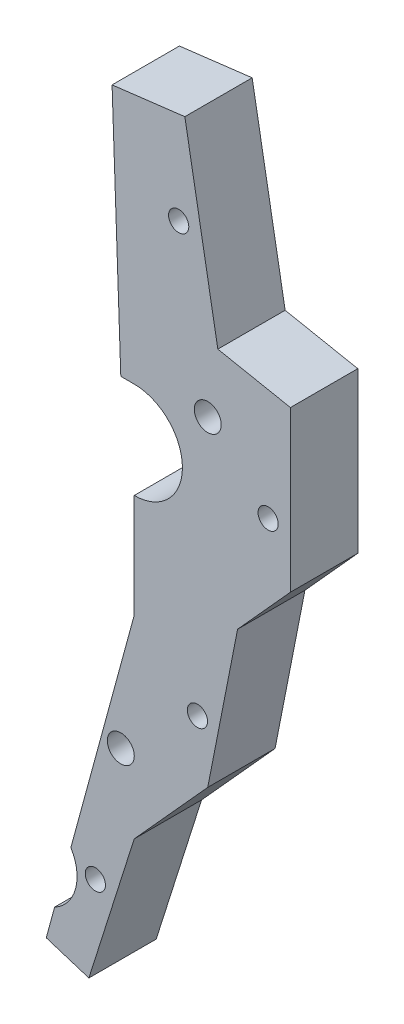
ISO-10303-21;
HEADER;
FILE_DESCRIPTION(('STEP AP214'),'2;1');
FILE_NAME('part.step','',(''),(''),'','','');
FILE_SCHEMA(('AUTOMOTIVE_DESIGN { 1 0 10303 214 1 1 1 1 }'));
ENDSEC;
DATA;
#1=APPLICATION_CONTEXT('core data for automotive mechanical design processes');
#2=APPLICATION_PROTOCOL_DEFINITION('international standard','automotive_design',2000,#1);
#3=PRODUCT_CONTEXT('',#1,'mechanical');
#4=PRODUCT('Part','Part','',(#3));
#5=PRODUCT_RELATED_PRODUCT_CATEGORY('part','',(#4));
#6=PRODUCT_DEFINITION_FORMATION('','',#4);
#7=PRODUCT_DEFINITION_CONTEXT('part definition',#1,'design');
#8=PRODUCT_DEFINITION('design','',#6,#7);
#9=PRODUCT_DEFINITION_SHAPE('','',#8);
#10=(LENGTH_UNIT() NAMED_UNIT(*) SI_UNIT(.MILLI.,.METRE.));
#11=(NAMED_UNIT(*) PLANE_ANGLE_UNIT() SI_UNIT($,.RADIAN.));
#12=(NAMED_UNIT(*) SI_UNIT($,.STERADIAN.) SOLID_ANGLE_UNIT());
#13=UNCERTAINTY_MEASURE_WITH_UNIT(LENGTH_MEASURE(1.E-05),#10,'distance_accuracy_value','');
#14=(GEOMETRIC_REPRESENTATION_CONTEXT(3) GLOBAL_UNCERTAINTY_ASSIGNED_CONTEXT((#13)) GLOBAL_UNIT_ASSIGNED_CONTEXT((#10,
#11,#12)) REPRESENTATION_CONTEXT('',''));
#15=CARTESIAN_POINT('',(0.,0.,0.));
#16=DIRECTION('',(0.,0.,1.));
#17=DIRECTION('',(1.,0.,0.));
#18=AXIS2_PLACEMENT_3D('',#15,#16,#17);
#19=CARTESIAN_POINT('',(-64.6270624834194,-32.1104240071964,5.));
#20=DIRECTION('',(0.964903774312297,-0.262603705834253,0.));
#21=DIRECTION('',(0.262603705834253,0.964903774312298,0.));
#22=AXIS2_PLACEMENT_3D('',#19,#20,#21);
#23=PLANE('',#22);
#24=DIRECTION('',(0.,0.,-1.));
#25=VECTOR('',#24,1.);
#26=CARTESIAN_POINT('',(-64.0052667859932,-29.8257151399258,5.));
#27=LINE('',#26,#25);
#28=CARTESIAN_POINT('',(-64.0052667859932,-29.8257151399258,0.));
#29=VERTEX_POINT('',#28);
#30=CARTESIAN_POINT('',(-64.0052667859932,-29.8257151399258,5.));
#31=VERTEX_POINT('',#30);
#32=EDGE_CURVE('E11',#29,#31,#27,.F.);
#33=ORIENTED_EDGE('',*,*,#32,.F.);
#34=DIRECTION('',(-0.262603705834253,-0.964903774312297,0.));
#35=VECTOR('',#34,1.);
#36=CARTESIAN_POINT('',(-64.6270624834194,-32.1104240071964,0.));
#37=LINE('',#36,#35);
#38=CARTESIAN_POINT('',(-64.6270624834194,-32.1104240071964,0.));
#39=VERTEX_POINT('',#38);
#40=EDGE_CURVE('E193',#29,#39,#37,.T.);
#41=ORIENTED_EDGE('',*,*,#40,.T.);
#42=DIRECTION('',(0.,0.,-1.));
#43=VECTOR('',#42,1.);
#44=CARTESIAN_POINT('',(-64.6270624834194,-32.1104240071964,5.));
#45=LINE('',#44,#43);
#46=CARTESIAN_POINT('',(-64.6270624834194,-32.1104240071964,5.));
#47=VERTEX_POINT('',#46);
#48=EDGE_CURVE('E227',#47,#39,#45,.T.);
#49=ORIENTED_EDGE('',*,*,#48,.F.);
#50=DIRECTION('',(-0.262603705834253,-0.964903774312297,0.));
#51=VECTOR('',#50,1.);
#52=CARTESIAN_POINT('',(-64.6270624834194,-32.1104240071964,5.));
#53=LINE('',#52,#51);
#54=EDGE_CURVE('E522',#31,#47,#53,.T.);
#55=ORIENTED_EDGE('',*,*,#54,.F.);
#56=EDGE_LOOP('',(#33,#41,#49,#55));
#57=FACE_BOUND('',#56,.T.);
#58=ADVANCED_FACE('F35',(#57),#23,.F.);
#59=DIRECTION('',(0.,0.,-1.));
#60=VECTOR('',#59,1.);
#61=CARTESIAN_POINT('',(-62.7993520569552,-25.3947355014205,5.));
#62=LINE('',#61,#60);
#63=CARTESIAN_POINT('',(-62.7993520569552,-25.3947355014206,5.));
#64=VERTEX_POINT('',#63);
#65=CARTESIAN_POINT('',(-62.7993520569552,-25.3947355014205,0.));
#66=VERTEX_POINT('',#65);
#67=EDGE_CURVE('E43',#64,#66,#62,.T.);
#68=ORIENTED_EDGE('',*,*,#67,.F.);
#69=CARTESIAN_POINT('',(-58.0949621613507,-8.10905572898634,5.));
#70=VERTEX_POINT('',#69);
#71=EDGE_CURVE('E263',#70,#64,#53,.T.);
#72=ORIENTED_EDGE('',*,*,#71,.F.);
#73=DIRECTION('',(0.,0.,-1.));
#74=VECTOR('',#73,1.);
#75=CARTESIAN_POINT('',(-58.0949621613507,-8.10905572898634,5.));
#76=LINE('',#75,#74);
#77=CARTESIAN_POINT('',(-58.0949621613507,-8.10905572898634,0.));
#78=VERTEX_POINT('',#77);
#79=EDGE_CURVE('E230',#70,#78,#76,.T.);
#80=ORIENTED_EDGE('',*,*,#79,.T.);
#81=EDGE_CURVE('E194',#78,#66,#37,.T.);
#82=ORIENTED_EDGE('',*,*,#81,.T.);
#83=EDGE_LOOP('',(#68,#72,#80,#82));
#84=FACE_BOUND('',#83,.T.);
#85=ADVANCED_FACE('F261',(#84),#23,.F.);
#86=CARTESIAN_POINT('',(-58.0949621613506,3.1829541663797,5.));
#87=DIRECTION('',(0.,0.,1.));
#88=DIRECTION('',(1.,0.,0.));
#89=AXIS2_PLACEMENT_3D('',#86,#87,#88);
#90=PLANE('',#89);
#91=CARTESIAN_POINT('',(-52.6347099416876,7.3759685460233,5.));
#92=DIRECTION('',(0.,0.,1.));
#93=DIRECTION('',(1.,0.,0.));
#94=AXIS2_PLACEMENT_3D('',#91,#92,#93);
#95=CIRCLE('',#94,0.999999999999998);
#96=CARTESIAN_POINT('',(-51.6347099416876,7.3759685460233,5.));
#97=VERTEX_POINT('',#96);
#98=EDGE_CURVE('E549',#97,#97,#95,.T.);
#99=ORIENTED_EDGE('',*,*,#98,.F.);
#100=EDGE_LOOP('',(#99));
#101=FACE_BOUND('',#100,.T.);
#102=CARTESIAN_POINT('',(-53.399319926023,-12.2184580763541,5.));
#103=DIRECTION('',(0.,0.,1.));
#104=DIRECTION('',(1.,0.,0.));
#105=AXIS2_PLACEMENT_3D('',#102,#103,#104);
#106=CIRCLE('',#105,0.749999999999999);
#107=CARTESIAN_POINT('',(-52.649319926023,-12.2184580763541,5.));
#108=VERTEX_POINT('',#107);
#109=EDGE_CURVE('E537',#108,#108,#106,.T.);
#110=ORIENTED_EDGE('',*,*,#109,.F.);
#111=EDGE_LOOP('',(#110));
#112=FACE_BOUND('',#111,.T.);
#113=CARTESIAN_POINT('',(-54.7928188943249,18.9064751102177,5.));
#114=DIRECTION('',(0.,0.,1.));
#115=DIRECTION('',(1.,0.,0.));
#116=AXIS2_PLACEMENT_3D('',#113,#114,#115);
#117=CIRCLE('',#116,0.749999999999999);
#118=CARTESIAN_POINT('',(-54.0428188943249,18.9064751102177,5.));
#119=VERTEX_POINT('',#118);
#120=EDGE_CURVE('E185',#119,#119,#117,.T.);
#121=ORIENTED_EDGE('',*,*,#120,.F.);
#122=EDGE_LOOP('',(#121));
#123=FACE_BOUND('',#122,.T.);
#124=ORIENTED_EDGE('',*,*,#71,.T.);
#125=CARTESIAN_POINT('',(-65.5,-27.0393276474756,5.));
#126=DIRECTION('',(0.,0.,1.));
#127=DIRECTION('',(1.,0.,0.));
#128=AXIS2_PLACEMENT_3D('',#125,#126,#127);
#129=CIRCLE('',#128,3.16199029712902);
#130=EDGE_CURVE('E49',#31,#64,#129,.T.);
#131=ORIENTED_EDGE('',*,*,#130,.F.);
#132=ORIENTED_EDGE('',*,*,#54,.T.);
#133=DIRECTION('',(0.953338527926626,-0.301903380522135,0.));
#134=VECTOR('',#133,1.);
#135=CARTESIAN_POINT('',(-61.4618614863453,-33.1127803088209,5.));
#136=LINE('',#135,#134);
#137=CARTESIAN_POINT('',(-61.4618614863453,-33.1127803088209,5.));
#138=VERTEX_POINT('',#137);
#139=EDGE_CURVE('E519',#47,#138,#136,.T.);
#140=ORIENTED_EDGE('',*,*,#139,.T.);
#141=DIRECTION('',(0.301903380522137,0.953338527926626,0.));
#142=VECTOR('',#141,1.);
#143=CARTESIAN_POINT('',(-58.0949621613506,-22.4809190801843,5.));
#144=LINE('',#143,#142);
#145=CARTESIAN_POINT('',(-58.0949621613506,-22.4809190801843,5.));
#146=VERTEX_POINT('',#145);
#147=EDGE_CURVE('E505',#138,#146,#144,.T.);
#148=ORIENTED_EDGE('',*,*,#147,.T.);
#149=DIRECTION('',(0.670547704013103,0.741866414284105,0.));
#150=VECTOR('',#149,1.);
#151=CARTESIAN_POINT('',(-52.6347099416876,-16.4399204889655,5.));
#152=LINE('',#151,#150);
#153=CARTESIAN_POINT('',(-52.6347099416876,-16.4399204889655,5.));
#154=VERTEX_POINT('',#153);
#155=EDGE_CURVE('E514',#146,#154,#152,.T.);
#156=ORIENTED_EDGE('',*,*,#155,.T.);
#157=DIRECTION('',(0.192745304030915,0.98124882052109,0.));
#158=VECTOR('',#157,1.);
#159=CARTESIAN_POINT('',(-50.4190039613222,-5.15996277074055,5.));
#160=LINE('',#159,#158);
#161=CARTESIAN_POINT('',(-50.4190039613222,-5.15996277074055,5.));
#162=VERTEX_POINT('',#161);
#163=EDGE_CURVE('E513',#154,#162,#160,.T.);
#164=ORIENTED_EDGE('',*,*,#163,.T.);
#165=DIRECTION('',(0.670547704013104,0.741866414284105,0.));
#166=VECTOR('',#165,1.);
#167=CARTESIAN_POINT('',(-46.4955603971455,-0.819226099535836,5.));
#168=LINE('',#167,#166);
#169=CARTESIAN_POINT('',(-46.4955603971455,-0.819226099535836,5.));
#170=VERTEX_POINT('',#169);
#171=EDGE_CURVE('E160',#162,#170,#168,.T.);
#172=ORIENTED_EDGE('',*,*,#171,.T.);
#173=DIRECTION('',(0.,1.,0.));
#174=VECTOR('',#173,1.);
#175=CARTESIAN_POINT('',(-46.4955603971455,11.0566586062873,5.));
#176=LINE('',#175,#174);
#177=CARTESIAN_POINT('',(-46.4955603971455,11.0566586062873,5.));
#178=VERTEX_POINT('',#177);
#179=EDGE_CURVE('E151',#170,#178,#176,.T.);
#180=ORIENTED_EDGE('',*,*,#179,.T.);
#181=DIRECTION('',(-0.98124882052109,0.192745304030914,0.));
#182=VECTOR('',#181,1.);
#183=CARTESIAN_POINT('',(-51.8868298768003,12.1156579683623,5.));
#184=LINE('',#183,#182);
#185=CARTESIAN_POINT('',(-51.8868298768003,12.1156579683623,5.));
#186=VERTEX_POINT('',#185);
#187=EDGE_CURVE('E157',#178,#186,#184,.T.);
#188=ORIENTED_EDGE('',*,*,#187,.T.);
#189=DIRECTION('',(-0.175637551850033,0.984454900125001,0.));
#190=VECTOR('',#189,1.);
#191=CARTESIAN_POINT('',(-54.3357419249867,25.841899540385,5.));
#192=LINE('',#191,#190);
#193=CARTESIAN_POINT('',(-54.3357419249867,25.841899540385,5.));
#194=VERTEX_POINT('',#193);
#195=EDGE_CURVE('E58',#186,#194,#192,.T.);
#196=ORIENTED_EDGE('',*,*,#195,.T.);
#197=DIRECTION('',(-0.99267873574417,-0.120784633134169,0.));
#198=VECTOR('',#197,1.);
#199=CARTESIAN_POINT('',(-59.7388068971846,25.1844791716715,5.));
#200=LINE('',#199,#198);
#201=CARTESIAN_POINT('',(-59.7388068971846,25.1844791716715,5.));
#202=VERTEX_POINT('',#201);
#203=EDGE_CURVE('E211',#194,#202,#200,.T.);
#204=ORIENTED_EDGE('',*,*,#203,.T.);
#205=DIRECTION('',(0.0351724724949258,-0.999381257167951,0.));
#206=VECTOR('',#205,1.);
#207=CARTESIAN_POINT('',(-59.090495063678,6.76351956184709,5.));
#208=LINE('',#207,#206);
#209=CARTESIAN_POINT('',(-59.090495063678,6.76351956184709,5.));
#210=VERTEX_POINT('',#209);
#211=EDGE_CURVE('E118',#202,#210,#208,.T.);
#212=ORIENTED_EDGE('',*,*,#211,.T.);
#213=DIRECTION('',(1.,0.,0.));
#214=VECTOR('',#213,1.);
#215=CARTESIAN_POINT('',(-58.0949621613506,6.76351956184709,5.));
#216=LINE('',#215,#214);
#217=CARTESIAN_POINT('',(-58.0949621613506,6.76351956184709,5.));
#218=VERTEX_POINT('',#217);
#219=EDGE_CURVE('E279',#210,#218,#216,.T.);
#220=ORIENTED_EDGE('',*,*,#219,.T.);
#221=CARTESIAN_POINT('',(-58.0949621613506,3.1829541663797,5.));
#222=DIRECTION('',(0.,0.,-1.));
#223=DIRECTION('',(1.,0.,0.));
#224=AXIS2_PLACEMENT_3D('',#221,#222,#223);
#225=CIRCLE('',#224,3.58056539546738);
#226=CARTESIAN_POINT('',(-58.0949621613506,-0.397611229087683,5.));
#227=VERTEX_POINT('',#226);
#228=EDGE_CURVE('E275',#218,#227,#225,.T.);
#229=ORIENTED_EDGE('',*,*,#228,.T.);
#230=DIRECTION('',(0.,-1.,0.));
#231=VECTOR('',#230,1.);
#232=CARTESIAN_POINT('',(-58.0949621613507,-8.10905572898634,5.));
#233=LINE('',#232,#231);
#234=EDGE_CURVE('E267',#227,#70,#233,.T.);
#235=ORIENTED_EDGE('',*,*,#234,.T.);
#236=EDGE_LOOP('',(#124,#131,#132,#140,#148,#156,#164,#172,#180,#188,#196,#204,#212,#220,#229,#235));
#237=FACE_BOUND('',#236,.T.);
#238=CARTESIAN_POINT('',(-48.15,3.1,5.));
#239=DIRECTION('',(0.,0.,1.));
#240=DIRECTION('',(1.,0.,0.));
#241=AXIS2_PLACEMENT_3D('',#238,#239,#240);
#242=CIRCLE('',#241,0.749999999999999);
#243=CARTESIAN_POINT('',(-47.4,3.1,5.));
#244=VERTEX_POINT('',#243);
#245=EDGE_CURVE('E531',#244,#244,#242,.T.);
#246=ORIENTED_EDGE('',*,*,#245,.F.);
#247=EDGE_LOOP('',(#246));
#248=FACE_BOUND('',#247,.T.);
#249=CARTESIAN_POINT('',(-60.9803468074253,-26.5271459598117,5.));
#250=DIRECTION('',(0.,0.,1.));
#251=DIRECTION('',(1.,0.,0.));
#252=AXIS2_PLACEMENT_3D('',#249,#250,#251);
#253=CIRCLE('',#252,0.749999999999999);
#254=CARTESIAN_POINT('',(-60.2303468074253,-26.5271459598117,5.));
#255=VERTEX_POINT('',#254);
#256=EDGE_CURVE('E543',#255,#255,#253,.T.);
#257=ORIENTED_EDGE('',*,*,#256,.F.);
#258=EDGE_LOOP('',(#257));
#259=FACE_BOUND('',#258,.T.);
#260=CARTESIAN_POINT('',(-59.090495063678,-17.1587756284956,5.));
#261=DIRECTION('',(0.,0.,1.));
#262=DIRECTION('',(1.,0.,0.));
#263=AXIS2_PLACEMENT_3D('',#260,#261,#262);
#264=CIRCLE('',#263,0.999999999999998);
#265=CARTESIAN_POINT('',(-58.090495063678,-17.1587756284956,5.));
#266=VERTEX_POINT('',#265);
#267=EDGE_CURVE('E555',#266,#266,#264,.T.);
#268=ORIENTED_EDGE('',*,*,#267,.F.);
#269=EDGE_LOOP('',(#268));
#270=FACE_BOUND('',#269,.T.);
#271=ADVANCED_FACE('F154',(#101,#112,#123,#237,#248,#259,#270),#90,.T.);
#272=CARTESIAN_POINT('',(-58.0949621613506,3.1829541663797,0.));
#273=DIRECTION('',(0.,0.,1.));
#274=DIRECTION('',(1.,0.,0.));
#275=AXIS2_PLACEMENT_3D('',#272,#273,#274);
#276=PLANE('',#275);
#277=CARTESIAN_POINT('',(-65.5,-27.0393276474756,0.));
#278=DIRECTION('',(0.,0.,1.));
#279=DIRECTION('',(1.,0.,0.));
#280=AXIS2_PLACEMENT_3D('',#277,#278,#279);
#281=CIRCLE('',#280,3.16199029712902);
#282=EDGE_CURVE('E248',#29,#66,#281,.T.);
#283=ORIENTED_EDGE('',*,*,#282,.T.);
#284=ORIENTED_EDGE('',*,*,#81,.F.);
#285=DIRECTION('',(0.,-1.,0.));
#286=VECTOR('',#285,1.);
#287=CARTESIAN_POINT('',(-58.0949621613507,-8.10905572898634,0.));
#288=LINE('',#287,#286);
#289=CARTESIAN_POINT('',(-58.0949621613506,-0.397611229087683,0.));
#290=VERTEX_POINT('',#289);
#291=EDGE_CURVE('E191',#290,#78,#288,.T.);
#292=ORIENTED_EDGE('',*,*,#291,.F.);
#293=CARTESIAN_POINT('',(-58.0949621613506,3.1829541663797,0.));
#294=DIRECTION('',(0.,0.,-1.));
#295=DIRECTION('',(1.,0.,0.));
#296=AXIS2_PLACEMENT_3D('',#293,#294,#295);
#297=CIRCLE('',#296,3.58056539546738);
#298=CARTESIAN_POINT('',(-58.0949621613506,6.76351956184709,0.));
#299=VERTEX_POINT('',#298);
#300=EDGE_CURVE('E189',#299,#290,#297,.T.);
#301=ORIENTED_EDGE('',*,*,#300,.F.);
#302=DIRECTION('',(1.,0.,0.));
#303=VECTOR('',#302,1.);
#304=CARTESIAN_POINT('',(-58.0949621613506,6.76351956184709,0.));
#305=LINE('',#304,#303);
#306=CARTESIAN_POINT('',(-59.090495063678,6.76351956184709,0.));
#307=VERTEX_POINT('',#306);
#308=EDGE_CURVE('E187',#307,#299,#305,.T.);
#309=ORIENTED_EDGE('',*,*,#308,.F.);
#310=DIRECTION('',(0.0351724724949258,-0.999381257167951,0.));
#311=VECTOR('',#310,1.);
#312=CARTESIAN_POINT('',(-59.090495063678,6.76351956184709,0.));
#313=LINE('',#312,#311);
#314=CARTESIAN_POINT('',(-59.7388068971846,25.1844791716715,0.));
#315=VERTEX_POINT('',#314);
#316=EDGE_CURVE('E184',#315,#307,#313,.T.);
#317=ORIENTED_EDGE('',*,*,#316,.F.);
#318=DIRECTION('',(-0.99267873574417,-0.120784633134169,0.));
#319=VECTOR('',#318,1.);
#320=CARTESIAN_POINT('',(-59.7388068971846,25.1844791716715,0.));
#321=LINE('',#320,#319);
#322=CARTESIAN_POINT('',(-54.3357419249867,25.841899540385,0.));
#323=VERTEX_POINT('',#322);
#324=EDGE_CURVE('E181',#323,#315,#321,.T.);
#325=ORIENTED_EDGE('',*,*,#324,.F.);
#326=DIRECTION('',(-0.175637551850033,0.984454900125001,0.));
#327=VECTOR('',#326,1.);
#328=CARTESIAN_POINT('',(-54.3357419249867,25.841899540385,0.));
#329=LINE('',#328,#327);
#330=CARTESIAN_POINT('',(-51.8868298768003,12.1156579683623,0.));
#331=VERTEX_POINT('',#330);
#332=EDGE_CURVE('E109',#331,#323,#329,.T.);
#333=ORIENTED_EDGE('',*,*,#332,.F.);
#334=DIRECTION('',(-0.98124882052109,0.192745304030914,0.));
#335=VECTOR('',#334,1.);
#336=CARTESIAN_POINT('',(-51.8868298768003,12.1156579683623,0.));
#337=LINE('',#336,#335);
#338=CARTESIAN_POINT('',(-46.4955603971455,11.0566586062873,0.));
#339=VERTEX_POINT('',#338);
#340=EDGE_CURVE('E208',#339,#331,#337,.T.);
#341=ORIENTED_EDGE('',*,*,#340,.F.);
#342=DIRECTION('',(0.,1.,0.));
#343=VECTOR('',#342,1.);
#344=CARTESIAN_POINT('',(-46.4955603971455,11.0566586062873,0.));
#345=LINE('',#344,#343);
#346=CARTESIAN_POINT('',(-46.4955603971455,-0.819226099535836,0.));
#347=VERTEX_POINT('',#346);
#348=EDGE_CURVE('E169',#347,#339,#345,.T.);
#349=ORIENTED_EDGE('',*,*,#348,.F.);
#350=DIRECTION('',(0.670547704013104,0.741866414284105,0.));
#351=VECTOR('',#350,1.);
#352=CARTESIAN_POINT('',(-46.4955603971455,-0.819226099535836,0.));
#353=LINE('',#352,#351);
#354=CARTESIAN_POINT('',(-50.4190039613222,-5.15996277074055,0.));
#355=VERTEX_POINT('',#354);
#356=EDGE_CURVE('E205',#355,#347,#353,.T.);
#357=ORIENTED_EDGE('',*,*,#356,.F.);
#358=DIRECTION('',(0.192745304030915,0.98124882052109,0.));
#359=VECTOR('',#358,1.);
#360=CARTESIAN_POINT('',(-50.4190039613222,-5.15996277074055,0.));
#361=LINE('',#360,#359);
#362=CARTESIAN_POINT('',(-52.6347099416876,-16.4399204889655,0.));
#363=VERTEX_POINT('',#362);
#364=EDGE_CURVE('E203',#363,#355,#361,.T.);
#365=ORIENTED_EDGE('',*,*,#364,.F.);
#366=DIRECTION('',(0.670547704013103,0.741866414284105,0.));
#367=VECTOR('',#366,1.);
#368=CARTESIAN_POINT('',(-52.6347099416876,-16.4399204889655,0.));
#369=LINE('',#368,#367);
#370=CARTESIAN_POINT('',(-58.0949621613506,-22.4809190801843,0.));
#371=VERTEX_POINT('',#370);
#372=EDGE_CURVE('E201',#371,#363,#369,.T.);
#373=ORIENTED_EDGE('',*,*,#372,.F.);
#374=DIRECTION('',(0.301903380522137,0.953338527926626,0.));
#375=VECTOR('',#374,1.);
#376=CARTESIAN_POINT('',(-58.0949621613506,-22.4809190801843,0.));
#377=LINE('',#376,#375);
#378=CARTESIAN_POINT('',(-61.4618614863453,-33.1127803088209,0.));
#379=VERTEX_POINT('',#378);
#380=EDGE_CURVE('E199',#379,#371,#377,.T.);
#381=ORIENTED_EDGE('',*,*,#380,.F.);
#382=DIRECTION('',(0.953338527926626,-0.301903380522135,0.));
#383=VECTOR('',#382,1.);
#384=CARTESIAN_POINT('',(-61.4618614863453,-33.1127803088209,0.));
#385=LINE('',#384,#383);
#386=EDGE_CURVE('E197',#39,#379,#385,.T.);
#387=ORIENTED_EDGE('',*,*,#386,.F.);
#388=ORIENTED_EDGE('',*,*,#40,.F.);
#389=EDGE_LOOP('',(#283,#284,#292,#301,#309,#317,#325,#333,#341,#349,#357,#365,#373,#381,#387,#388));
#390=FACE_BOUND('',#389,.T.);
#391=CARTESIAN_POINT('',(-54.7928188943249,18.9064751102177,0.));
#392=DIRECTION('',(0.,0.,1.));
#393=DIRECTION('',(1.,0.,0.));
#394=AXIS2_PLACEMENT_3D('',#391,#392,#393);
#395=CIRCLE('',#394,0.749999999999999);
#396=CARTESIAN_POINT('',(-54.0428188943249,18.9064751102177,0.));
#397=VERTEX_POINT('',#396);
#398=EDGE_CURVE('E528',#397,#397,#395,.T.);
#399=ORIENTED_EDGE('',*,*,#398,.T.);
#400=EDGE_LOOP('',(#399));
#401=FACE_BOUND('',#400,.T.);
#402=CARTESIAN_POINT('',(-48.15,3.1,0.));
#403=DIRECTION('',(0.,0.,1.));
#404=DIRECTION('',(1.,0.,0.));
#405=AXIS2_PLACEMENT_3D('',#402,#403,#404);
#406=CIRCLE('',#405,0.749999999999999);
#407=CARTESIAN_POINT('',(-47.4,3.1,0.));
#408=VERTEX_POINT('',#407);
#409=EDGE_CURVE('E534',#408,#408,#406,.T.);
#410=ORIENTED_EDGE('',*,*,#409,.T.);
#411=EDGE_LOOP('',(#410));
#412=FACE_BOUND('',#411,.T.);
#413=CARTESIAN_POINT('',(-53.399319926023,-12.2184580763541,0.));
#414=DIRECTION('',(0.,0.,1.));
#415=DIRECTION('',(1.,0.,0.));
#416=AXIS2_PLACEMENT_3D('',#413,#414,#415);
#417=CIRCLE('',#416,0.749999999999999);
#418=CARTESIAN_POINT('',(-52.649319926023,-12.2184580763541,0.));
#419=VERTEX_POINT('',#418);
#420=EDGE_CURVE('E540',#419,#419,#417,.T.);
#421=ORIENTED_EDGE('',*,*,#420,.T.);
#422=EDGE_LOOP('',(#421));
#423=FACE_BOUND('',#422,.T.);
#424=CARTESIAN_POINT('',(-60.9803468074253,-26.5271459598117,0.));
#425=DIRECTION('',(0.,0.,1.));
#426=DIRECTION('',(1.,0.,0.));
#427=AXIS2_PLACEMENT_3D('',#424,#425,#426);
#428=CIRCLE('',#427,0.749999999999999);
#429=CARTESIAN_POINT('',(-60.2303468074253,-26.5271459598117,0.));
#430=VERTEX_POINT('',#429);
#431=EDGE_CURVE('E546',#430,#430,#428,.T.);
#432=ORIENTED_EDGE('',*,*,#431,.T.);
#433=EDGE_LOOP('',(#432));
#434=FACE_BOUND('',#433,.T.);
#435=CARTESIAN_POINT('',(-52.6347099416876,7.3759685460233,0.));
#436=DIRECTION('',(0.,0.,1.));
#437=DIRECTION('',(1.,0.,0.));
#438=AXIS2_PLACEMENT_3D('',#435,#436,#437);
#439=CIRCLE('',#438,0.999999999999998);
#440=CARTESIAN_POINT('',(-51.6347099416876,7.3759685460233,0.));
#441=VERTEX_POINT('',#440);
#442=EDGE_CURVE('E552',#441,#441,#439,.T.);
#443=ORIENTED_EDGE('',*,*,#442,.T.);
#444=EDGE_LOOP('',(#443));
#445=FACE_BOUND('',#444,.T.);
#446=CARTESIAN_POINT('',(-59.090495063678,-17.1587756284956,0.));
#447=DIRECTION('',(0.,0.,1.));
#448=DIRECTION('',(1.,0.,0.));
#449=AXIS2_PLACEMENT_3D('',#446,#447,#448);
#450=CIRCLE('',#449,0.999999999999998);
#451=CARTESIAN_POINT('',(-58.090495063678,-17.1587756284956,0.));
#452=VERTEX_POINT('',#451);
#453=EDGE_CURVE('E558',#452,#452,#450,.T.);
#454=ORIENTED_EDGE('',*,*,#453,.T.);
#455=EDGE_LOOP('',(#454));
#456=FACE_BOUND('',#455,.T.);
#457=ADVANCED_FACE('F256',(#390,#401,#412,#423,#434,#445,#456),#276,.F.);
#458=CARTESIAN_POINT('',(-59.7388068971846,25.1844791716715,5.));
#459=DIRECTION('',(0.120784633134169,-0.99267873574417,0.));
#460=DIRECTION('',(0.99267873574417,0.120784633134169,0.));
#461=AXIS2_PLACEMENT_3D('',#458,#459,#460);
#462=PLANE('',#461);
#463=ORIENTED_EDGE('',*,*,#324,.T.);
#464=DIRECTION('',(0.,0.,-1.));
#465=VECTOR('',#464,1.);
#466=CARTESIAN_POINT('',(-59.7388068971846,25.1844791716715,5.));
#467=LINE('',#466,#465);
#468=EDGE_CURVE('E242',#202,#315,#467,.T.);
#469=ORIENTED_EDGE('',*,*,#468,.F.);
#470=ORIENTED_EDGE('',*,*,#203,.F.);
#471=DIRECTION('',(0.,0.,-1.));
#472=VECTOR('',#471,1.);
#473=CARTESIAN_POINT('',(-54.3357419249867,25.841899540385,5.));
#474=LINE('',#473,#472);
#475=EDGE_CURVE('E177',#194,#323,#474,.T.);
#476=ORIENTED_EDGE('',*,*,#475,.T.);
#477=EDGE_LOOP('',(#463,#469,#470,#476));
#478=FACE_BOUND('',#477,.T.);
#479=ADVANCED_FACE('F37',(#478),#462,.F.);
#480=CARTESIAN_POINT('',(-59.090495063678,6.76351956184709,5.));
#481=DIRECTION('',(0.999381257167951,0.0351724724949258,0.));
#482=DIRECTION('',(-0.0351724724949258,0.999381257167951,0.));
#483=AXIS2_PLACEMENT_3D('',#480,#481,#482);
#484=PLANE('',#483);
#485=ORIENTED_EDGE('',*,*,#316,.T.);
#486=DIRECTION('',(0.,0.,-1.));
#487=VECTOR('',#486,1.);
#488=CARTESIAN_POINT('',(-59.090495063678,6.76351956184709,5.));
#489=LINE('',#488,#487);
#490=EDGE_CURVE('E239',#210,#307,#489,.T.);
#491=ORIENTED_EDGE('',*,*,#490,.F.);
#492=ORIENTED_EDGE('',*,*,#211,.F.);
#493=ORIENTED_EDGE('',*,*,#468,.T.);
#494=EDGE_LOOP('',(#485,#491,#492,#493));
#495=FACE_BOUND('',#494,.T.);
#496=ADVANCED_FACE('F280',(#495),#484,.F.);
#497=CARTESIAN_POINT('',(-58.0949621613506,6.76351956184709,5.));
#498=DIRECTION('',(0.,1.,0.));
#499=DIRECTION('',(0.,0.,1.));
#500=AXIS2_PLACEMENT_3D('',#497,#498,#499);
#501=PLANE('',#500);
#502=ORIENTED_EDGE('',*,*,#308,.T.);
#503=DIRECTION('',(0.,0.,-1.));
#504=VECTOR('',#503,1.);
#505=CARTESIAN_POINT('',(-58.0949621613506,6.76351956184709,5.));
#506=LINE('',#505,#504);
#507=EDGE_CURVE('E236',#218,#299,#506,.T.);
#508=ORIENTED_EDGE('',*,*,#507,.F.);
#509=ORIENTED_EDGE('',*,*,#219,.F.);
#510=ORIENTED_EDGE('',*,*,#490,.T.);
#511=EDGE_LOOP('',(#502,#508,#509,#510));
#512=FACE_BOUND('',#511,.T.);
#513=ADVANCED_FACE('F278',(#512),#501,.F.);
#514=CARTESIAN_POINT('',(-58.0949621613506,3.1829541663797,5.));
#515=DIRECTION('',(0.,0.,-1.));
#516=DIRECTION('',(-1.,0.,0.));
#517=AXIS2_PLACEMENT_3D('',#514,#515,#516);
#518=CYLINDRICAL_SURFACE('',#517,3.58056539546738);
#519=ORIENTED_EDGE('',*,*,#300,.T.);
#520=DIRECTION('',(0.,0.,-1.));
#521=VECTOR('',#520,1.);
#522=CARTESIAN_POINT('',(-58.0949621613506,-0.397611229087683,5.));
#523=LINE('',#522,#521);
#524=EDGE_CURVE('E233',#227,#290,#523,.T.);
#525=ORIENTED_EDGE('',*,*,#524,.F.);
#526=ORIENTED_EDGE('',*,*,#228,.F.);
#527=ORIENTED_EDGE('',*,*,#507,.T.);
#528=EDGE_LOOP('',(#519,#525,#526,#527));
#529=FACE_BOUND('',#528,.T.);
#530=ADVANCED_FACE('F272',(#529),#518,.F.);
#531=CARTESIAN_POINT('',(-58.0949621613507,-8.10905572898634,5.));
#532=DIRECTION('',(1.,0.,0.));
#533=DIRECTION('',(0.,1.,0.));
#534=AXIS2_PLACEMENT_3D('',#531,#532,#533);
#535=PLANE('',#534);
#536=ORIENTED_EDGE('',*,*,#291,.T.);
#537=ORIENTED_EDGE('',*,*,#79,.F.);
#538=ORIENTED_EDGE('',*,*,#234,.F.);
#539=ORIENTED_EDGE('',*,*,#524,.T.);
#540=EDGE_LOOP('',(#536,#537,#538,#539));
#541=FACE_BOUND('',#540,.T.);
#542=ADVANCED_FACE('F266',(#541),#535,.F.);
#543=CARTESIAN_POINT('',(-61.4618614863453,-33.1127803088209,5.));
#544=DIRECTION('',(0.301903380522135,0.953338527926626,0.));
#545=DIRECTION('',(-0.953338527926626,0.301903380522135,0.));
#546=AXIS2_PLACEMENT_3D('',#543,#544,#545);
#547=PLANE('',#546);
#548=ORIENTED_EDGE('',*,*,#386,.T.);
#549=DIRECTION('',(0.,0.,-1.));
#550=VECTOR('',#549,1.);
#551=CARTESIAN_POINT('',(-61.4618614863453,-33.1127803088209,5.));
#552=LINE('',#551,#550);
#553=EDGE_CURVE('E224',#138,#379,#552,.T.);
#554=ORIENTED_EDGE('',*,*,#553,.F.);
#555=ORIENTED_EDGE('',*,*,#139,.F.);
#556=ORIENTED_EDGE('',*,*,#48,.T.);
#557=EDGE_LOOP('',(#548,#554,#555,#556));
#558=FACE_BOUND('',#557,.T.);
#559=ADVANCED_FACE('F306',(#558),#547,.F.);
#560=CARTESIAN_POINT('',(-58.0949621613506,-22.4809190801843,5.));
#561=DIRECTION('',(-0.953338527926626,0.301903380522137,0.));
#562=DIRECTION('',(-0.301903380522137,-0.953338527926626,0.));
#563=AXIS2_PLACEMENT_3D('',#560,#561,#562);
#564=PLANE('',#563);
#565=ORIENTED_EDGE('',*,*,#380,.T.);
#566=DIRECTION('',(0.,0.,-1.));
#567=VECTOR('',#566,1.);
#568=CARTESIAN_POINT('',(-58.0949621613506,-22.4809190801843,5.));
#569=LINE('',#568,#567);
#570=EDGE_CURVE('E221',#146,#371,#569,.T.);
#571=ORIENTED_EDGE('',*,*,#570,.F.);
#572=ORIENTED_EDGE('',*,*,#147,.F.);
#573=ORIENTED_EDGE('',*,*,#553,.T.);
#574=EDGE_LOOP('',(#565,#571,#572,#573));
#575=FACE_BOUND('',#574,.T.);
#576=ADVANCED_FACE('F420',(#575),#564,.F.);
#577=CARTESIAN_POINT('',(-52.6347099416876,-16.4399204889655,5.));
#578=DIRECTION('',(-0.741866414284105,0.670547704013103,0.));
#579=DIRECTION('',(-0.670547704013103,-0.741866414284105,0.));
#580=AXIS2_PLACEMENT_3D('',#577,#578,#579);
#581=PLANE('',#580);
#582=ORIENTED_EDGE('',*,*,#372,.T.);
#583=DIRECTION('',(0.,0.,-1.));
#584=VECTOR('',#583,1.);
#585=CARTESIAN_POINT('',(-52.6347099416876,-16.4399204889655,5.));
#586=LINE('',#585,#584);
#587=EDGE_CURVE('E218',#154,#363,#586,.T.);
#588=ORIENTED_EDGE('',*,*,#587,.F.);
#589=ORIENTED_EDGE('',*,*,#155,.F.);
#590=ORIENTED_EDGE('',*,*,#570,.T.);
#591=EDGE_LOOP('',(#582,#588,#589,#590));
#592=FACE_BOUND('',#591,.T.);
#593=ADVANCED_FACE('F410',(#592),#581,.F.);
#594=CARTESIAN_POINT('',(-50.4190039613222,-5.15996277074055,5.));
#595=DIRECTION('',(-0.98124882052109,0.192745304030915,0.));
#596=DIRECTION('',(-0.192745304030915,-0.98124882052109,0.));
#597=AXIS2_PLACEMENT_3D('',#594,#595,#596);
#598=PLANE('',#597);
#599=ORIENTED_EDGE('',*,*,#364,.T.);
#600=DIRECTION('',(0.,0.,-1.));
#601=VECTOR('',#600,1.);
#602=CARTESIAN_POINT('',(-50.4190039613222,-5.15996277074055,5.));
#603=LINE('',#602,#601);
#604=EDGE_CURVE('E215',#162,#355,#603,.T.);
#605=ORIENTED_EDGE('',*,*,#604,.F.);
#606=ORIENTED_EDGE('',*,*,#163,.F.);
#607=ORIENTED_EDGE('',*,*,#587,.T.);
#608=EDGE_LOOP('',(#599,#605,#606,#607));
#609=FACE_BOUND('',#608,.T.);
#610=ADVANCED_FACE('F400',(#609),#598,.F.);
#611=CARTESIAN_POINT('',(-46.4955603971455,-0.819226099535836,5.));
#612=DIRECTION('',(-0.741866414284105,0.670547704013104,0.));
#613=DIRECTION('',(-0.670547704013104,-0.741866414284105,0.));
#614=AXIS2_PLACEMENT_3D('',#611,#612,#613);
#615=PLANE('',#614);
#616=ORIENTED_EDGE('',*,*,#356,.T.);
#617=DIRECTION('',(0.,0.,-1.));
#618=VECTOR('',#617,1.);
#619=CARTESIAN_POINT('',(-46.4955603971455,-0.819226099535836,5.));
#620=LINE('',#619,#618);
#621=EDGE_CURVE('E172',#170,#347,#620,.T.);
#622=ORIENTED_EDGE('',*,*,#621,.F.);
#623=ORIENTED_EDGE('',*,*,#171,.F.);
#624=ORIENTED_EDGE('',*,*,#604,.T.);
#625=EDGE_LOOP('',(#616,#622,#623,#624));
#626=FACE_BOUND('',#625,.T.);
#627=ADVANCED_FACE('F391',(#626),#615,.F.);
#628=CARTESIAN_POINT('',(-46.4955603971455,11.0566586062873,5.));
#629=DIRECTION('',(-1.,0.,0.));
#630=DIRECTION('',(0.,0.,1.));
#631=AXIS2_PLACEMENT_3D('',#628,#629,#630);
#632=PLANE('',#631);
#633=ORIENTED_EDGE('',*,*,#348,.T.);
#634=DIRECTION('',(0.,0.,-1.));
#635=VECTOR('',#634,1.);
#636=CARTESIAN_POINT('',(-46.4955603971455,11.0566586062873,5.));
#637=LINE('',#636,#635);
#638=EDGE_CURVE('E166',#178,#339,#637,.T.);
#639=ORIENTED_EDGE('',*,*,#638,.F.);
#640=ORIENTED_EDGE('',*,*,#179,.F.);
#641=ORIENTED_EDGE('',*,*,#621,.T.);
#642=EDGE_LOOP('',(#633,#639,#640,#641));
#643=FACE_BOUND('',#642,.T.);
#644=ADVANCED_FACE('F167',(#643),#632,.F.);
#645=CARTESIAN_POINT('',(-51.8868298768003,12.1156579683623,5.));
#646=DIRECTION('',(-0.192745304030914,-0.98124882052109,0.));
#647=DIRECTION('',(0.98124882052109,-0.192745304030914,0.));
#648=AXIS2_PLACEMENT_3D('',#645,#646,#647);
#649=PLANE('',#648);
#650=ORIENTED_EDGE('',*,*,#340,.T.);
#651=DIRECTION('',(0.,0.,-1.));
#652=VECTOR('',#651,1.);
#653=CARTESIAN_POINT('',(-51.8868298768003,12.1156579683623,5.));
#654=LINE('',#653,#652);
#655=EDGE_CURVE('E173',#186,#331,#654,.T.);
#656=ORIENTED_EDGE('',*,*,#655,.F.);
#657=ORIENTED_EDGE('',*,*,#187,.F.);
#658=ORIENTED_EDGE('',*,*,#638,.T.);
#659=EDGE_LOOP('',(#650,#656,#657,#658));
#660=FACE_BOUND('',#659,.T.);
#661=ADVANCED_FACE('F175',(#660),#649,.F.);
#662=CARTESIAN_POINT('',(-54.3357419249867,25.841899540385,5.));
#663=DIRECTION('',(-0.984454900125002,-0.175637551850034,0.));
#664=DIRECTION('',(0.175637551850034,-0.984454900125002,0.));
#665=AXIS2_PLACEMENT_3D('',#662,#663,#664);
#666=PLANE('',#665);
#667=ORIENTED_EDGE('',*,*,#332,.T.);
#668=ORIENTED_EDGE('',*,*,#475,.F.);
#669=ORIENTED_EDGE('',*,*,#195,.F.);
#670=ORIENTED_EDGE('',*,*,#655,.T.);
#671=EDGE_LOOP('',(#667,#668,#669,#670));
#672=FACE_BOUND('',#671,.T.);
#673=ADVANCED_FACE('F285',(#672),#666,.F.);
#674=CARTESIAN_POINT('',(-54.7928188943249,18.9064751102177,5.));
#675=DIRECTION('',(0.,0.,-1.));
#676=DIRECTION('',(-1.,0.,0.));
#677=AXIS2_PLACEMENT_3D('',#674,#675,#676);
#678=CYLINDRICAL_SURFACE('',#677,0.749999999999999);
#679=ORIENTED_EDGE('',*,*,#120,.T.);
#680=EDGE_LOOP('',(#679));
#681=FACE_BOUND('',#680,.T.);
#682=ORIENTED_EDGE('',*,*,#398,.F.);
#683=EDGE_LOOP('',(#682));
#684=FACE_BOUND('',#683,.T.);
#685=ADVANCED_FACE('F287',(#681,#684),#678,.F.);
#686=CARTESIAN_POINT('',(-48.15,3.1,5.));
#687=DIRECTION('',(0.,0.,-1.));
#688=DIRECTION('',(-1.,0.,0.));
#689=AXIS2_PLACEMENT_3D('',#686,#687,#688);
#690=CYLINDRICAL_SURFACE('',#689,0.749999999999999);
#691=ORIENTED_EDGE('',*,*,#245,.T.);
#692=EDGE_LOOP('',(#691));
#693=FACE_BOUND('',#692,.T.);
#694=ORIENTED_EDGE('',*,*,#409,.F.);
#695=EDGE_LOOP('',(#694));
#696=FACE_BOUND('',#695,.T.);
#697=ADVANCED_FACE('F293',(#693,#696),#690,.F.);
#698=CARTESIAN_POINT('',(-53.399319926023,-12.2184580763541,5.));
#699=DIRECTION('',(0.,0.,-1.));
#700=DIRECTION('',(-1.,0.,0.));
#701=AXIS2_PLACEMENT_3D('',#698,#699,#700);
#702=CYLINDRICAL_SURFACE('',#701,0.749999999999999);
#703=ORIENTED_EDGE('',*,*,#109,.T.);
#704=EDGE_LOOP('',(#703));
#705=FACE_BOUND('',#704,.T.);
#706=ORIENTED_EDGE('',*,*,#420,.F.);
#707=EDGE_LOOP('',(#706));
#708=FACE_BOUND('',#707,.T.);
#709=ADVANCED_FACE('F328',(#705,#708),#702,.F.);
#710=CARTESIAN_POINT('',(-60.9803468074253,-26.5271459598117,5.));
#711=DIRECTION('',(0.,0.,-1.));
#712=DIRECTION('',(-1.,0.,0.));
#713=AXIS2_PLACEMENT_3D('',#710,#711,#712);
#714=CYLINDRICAL_SURFACE('',#713,0.749999999999999);
#715=ORIENTED_EDGE('',*,*,#256,.T.);
#716=EDGE_LOOP('',(#715));
#717=FACE_BOUND('',#716,.T.);
#718=ORIENTED_EDGE('',*,*,#431,.F.);
#719=EDGE_LOOP('',(#718));
#720=FACE_BOUND('',#719,.T.);
#721=ADVANCED_FACE('F332',(#717,#720),#714,.F.);
#722=CARTESIAN_POINT('',(-52.6347099416876,7.3759685460233,5.));
#723=DIRECTION('',(0.,0.,-1.));
#724=DIRECTION('',(-1.,0.,0.));
#725=AXIS2_PLACEMENT_3D('',#722,#723,#724);
#726=CYLINDRICAL_SURFACE('',#725,0.999999999999998);
#727=ORIENTED_EDGE('',*,*,#98,.T.);
#728=EDGE_LOOP('',(#727));
#729=FACE_BOUND('',#728,.T.);
#730=ORIENTED_EDGE('',*,*,#442,.F.);
#731=EDGE_LOOP('',(#730));
#732=FACE_BOUND('',#731,.T.);
#733=ADVANCED_FACE('F336',(#729,#732),#726,.F.);
#734=CARTESIAN_POINT('',(-59.090495063678,-17.1587756284956,5.));
#735=DIRECTION('',(0.,0.,-1.));
#736=DIRECTION('',(-1.,0.,0.));
#737=AXIS2_PLACEMENT_3D('',#734,#735,#736);
#738=CYLINDRICAL_SURFACE('',#737,0.999999999999998);
#739=ORIENTED_EDGE('',*,*,#267,.T.);
#740=EDGE_LOOP('',(#739));
#741=FACE_BOUND('',#740,.T.);
#742=ORIENTED_EDGE('',*,*,#453,.F.);
#743=EDGE_LOOP('',(#742));
#744=FACE_BOUND('',#743,.T.);
#745=ADVANCED_FACE('F340',(#741,#744),#738,.F.);
#746=CARTESIAN_POINT('',(-65.5,-27.0393276474756,5.));
#747=DIRECTION('',(0.,0.,-1.));
#748=DIRECTION('',(-1.,0.,0.));
#749=AXIS2_PLACEMENT_3D('',#746,#747,#748);
#750=CYLINDRICAL_SURFACE('',#749,3.16199029712902);
#751=ORIENTED_EDGE('',*,*,#32,.T.);
#752=ORIENTED_EDGE('',*,*,#130,.T.);
#753=ORIENTED_EDGE('',*,*,#67,.T.);
#754=ORIENTED_EDGE('',*,*,#282,.F.);
#755=EDGE_LOOP('',(#751,#752,#753,#754));
#756=FACE_BOUND('',#755,.T.);
#757=ADVANCED_FACE('F246',(#756),#750,.F.);
#758=CLOSED_SHELL('',(#58,#85,#271,#457,#479,#496,#513,#530,#542,#559,#576,#593,#610,#627,#644,
#661,#673,#685,#697,#709,#721,#733,#745,#757));
#759=MANIFOLD_SOLID_BREP('B2',#758);
#760=ADVANCED_BREP_SHAPE_REPRESENTATION('',(#18,#759),#14);
#761=SHAPE_DEFINITION_REPRESENTATION(#9,#760);
ENDSEC;
END-ISO-10303-21;
